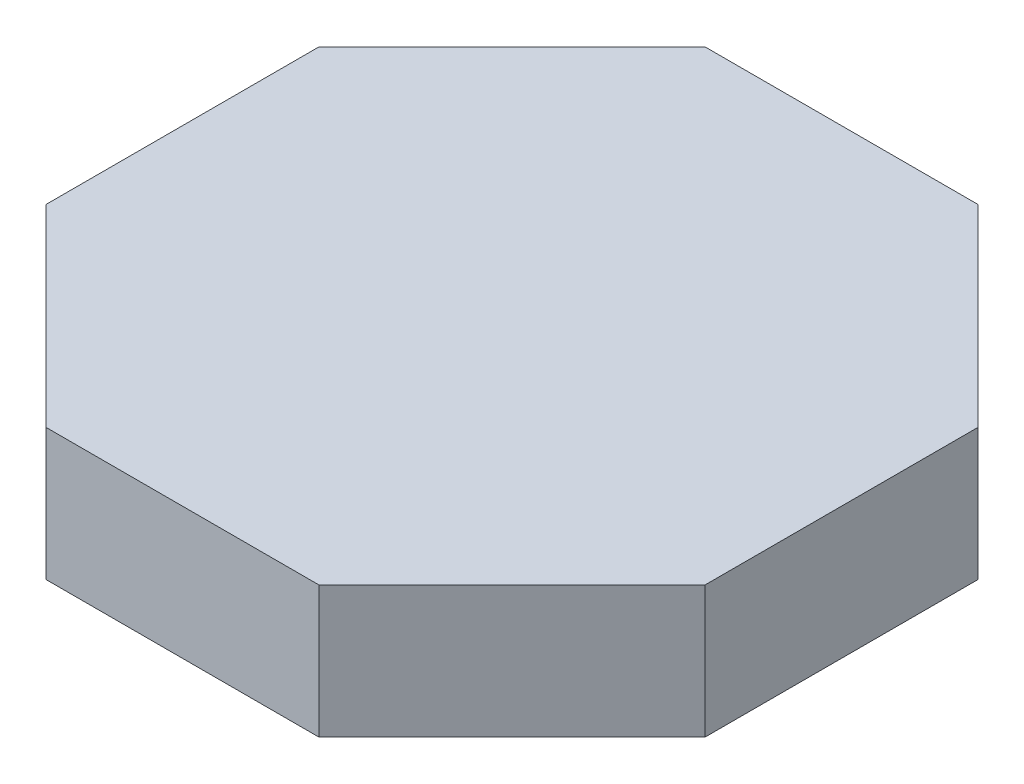
ISO-10303-21;
HEADER;
FILE_DESCRIPTION(('STEP AP214'),'2;1');
FILE_NAME('part.step','',(''),(''),'','','');
FILE_SCHEMA(('AUTOMOTIVE_DESIGN { 1 0 10303 214 1 1 1 1 }'));
ENDSEC;
DATA;
#1=APPLICATION_CONTEXT('core data for automotive mechanical design processes');
#2=APPLICATION_PROTOCOL_DEFINITION('international standard','automotive_design',2000,#1);
#3=PRODUCT_CONTEXT('',#1,'mechanical');
#4=PRODUCT('Part','Part','',(#3));
#5=PRODUCT_RELATED_PRODUCT_CATEGORY('part','',(#4));
#6=PRODUCT_DEFINITION_FORMATION('','',#4);
#7=PRODUCT_DEFINITION_CONTEXT('part definition',#1,'design');
#8=PRODUCT_DEFINITION('design','',#6,#7);
#9=PRODUCT_DEFINITION_SHAPE('','',#8);
#10=(LENGTH_UNIT() NAMED_UNIT(*) SI_UNIT(.MILLI.,.METRE.));
#11=(NAMED_UNIT(*) PLANE_ANGLE_UNIT() SI_UNIT($,.RADIAN.));
#12=(NAMED_UNIT(*) SI_UNIT($,.STERADIAN.) SOLID_ANGLE_UNIT());
#13=UNCERTAINTY_MEASURE_WITH_UNIT(LENGTH_MEASURE(1.E-05),#10,'distance_accuracy_value','');
#14=(GEOMETRIC_REPRESENTATION_CONTEXT(3) GLOBAL_UNCERTAINTY_ASSIGNED_CONTEXT((#13)) GLOBAL_UNIT_ASSIGNED_CONTEXT((#10,
#11,#12)) REPRESENTATION_CONTEXT('',''));
#15=CARTESIAN_POINT('',(0.,0.,0.));
#16=DIRECTION('',(0.,0.,1.));
#17=DIRECTION('',(1.,0.,0.));
#18=AXIS2_PLACEMENT_3D('',#15,#16,#17);
#19=CARTESIAN_POINT('',(10.3553390593274,10.,-25.));
#20=DIRECTION('',(0.,0.,1.));
#21=DIRECTION('',(1.,0.,0.));
#22=AXIS2_PLACEMENT_3D('',#19,#20,#21);
#23=PLANE('',#22);
#24=DIRECTION('',(-1.,0.,0.));
#25=VECTOR('',#24,1.);
#26=CARTESIAN_POINT('',(10.3553390593274,0.,-25.));
#27=LINE('',#26,#25);
#28=CARTESIAN_POINT('',(10.3553390593274,0.,-25.));
#29=VERTEX_POINT('',#28);
#30=CARTESIAN_POINT('',(-10.3553390593274,0.,-25.));
#31=VERTEX_POINT('',#30);
#32=EDGE_CURVE('E145',#29,#31,#27,.T.);
#33=ORIENTED_EDGE('',*,*,#32,.T.);
#34=DIRECTION('',(0.,-1.,0.));
#35=VECTOR('',#34,1.);
#36=CARTESIAN_POINT('',(-10.3553390593274,10.,-25.));
#37=LINE('',#36,#35);
#38=CARTESIAN_POINT('',(-10.3553390593274,10.,-25.));
#39=VERTEX_POINT('',#38);
#40=EDGE_CURVE('E12',#39,#31,#37,.T.);
#41=ORIENTED_EDGE('',*,*,#40,.F.);
#42=DIRECTION('',(-1.,0.,0.));
#43=VECTOR('',#42,1.);
#44=CARTESIAN_POINT('',(10.3553390593274,10.,-25.));
#45=LINE('',#44,#43);
#46=CARTESIAN_POINT('',(10.3553390593274,10.,-25.));
#47=VERTEX_POINT('',#46);
#48=EDGE_CURVE('E159',#47,#39,#45,.T.);
#49=ORIENTED_EDGE('',*,*,#48,.F.);
#50=DIRECTION('',(0.,-1.,0.));
#51=VECTOR('',#50,1.);
#52=CARTESIAN_POINT('',(10.3553390593274,10.,-25.));
#53=LINE('',#52,#51);
#54=EDGE_CURVE('E141',#47,#29,#53,.T.);
#55=ORIENTED_EDGE('',*,*,#54,.T.);
#56=EDGE_LOOP('',(#33,#41,#49,#55));
#57=FACE_BOUND('',#56,.T.);
#58=ADVANCED_FACE('F49',(#57),#23,.F.);
#59=CARTESIAN_POINT('',(-10.3553390593274,10.,-25.));
#60=DIRECTION('',(0.707106781186548,0.,0.707106781186547));
#61=DIRECTION('',(0.707106781186547,0.,-0.707106781186548));
#62=AXIS2_PLACEMENT_3D('',#59,#60,#61);
#63=PLANE('',#62);
#64=DIRECTION('',(-0.707106781186547,0.,0.707106781186548));
#65=VECTOR('',#64,1.);
#66=CARTESIAN_POINT('',(-10.3553390593274,0.,-25.));
#67=LINE('',#66,#65);
#68=CARTESIAN_POINT('',(-25.,0.,-10.3553390593274));
#69=VERTEX_POINT('',#68);
#70=EDGE_CURVE('E148',#31,#69,#67,.T.);
#71=ORIENTED_EDGE('',*,*,#70,.T.);
#72=DIRECTION('',(0.,-1.,0.));
#73=VECTOR('',#72,1.);
#74=CARTESIAN_POINT('',(-25.,10.,-10.3553390593274));
#75=LINE('',#74,#73);
#76=CARTESIAN_POINT('',(-25.,10.,-10.3553390593274));
#77=VERTEX_POINT('',#76);
#78=EDGE_CURVE('E57',#77,#69,#75,.T.);
#79=ORIENTED_EDGE('',*,*,#78,.F.);
#80=DIRECTION('',(-0.707106781186547,0.,0.707106781186548));
#81=VECTOR('',#80,1.);
#82=CARTESIAN_POINT('',(-10.3553390593274,10.,-25.));
#83=LINE('',#82,#81);
#84=EDGE_CURVE('E108',#39,#77,#83,.T.);
#85=ORIENTED_EDGE('',*,*,#84,.F.);
#86=ORIENTED_EDGE('',*,*,#40,.T.);
#87=EDGE_LOOP('',(#71,#79,#85,#86));
#88=FACE_BOUND('',#87,.T.);
#89=ADVANCED_FACE('F194',(#88),#63,.F.);
#90=CARTESIAN_POINT('',(-25.,10.,-10.3553390593274));
#91=DIRECTION('',(1.,0.,0.));
#92=DIRECTION('',(0.,0.,-1.));
#93=AXIS2_PLACEMENT_3D('',#90,#91,#92);
#94=PLANE('',#93);
#95=DIRECTION('',(0.,0.,1.));
#96=VECTOR('',#95,1.);
#97=CARTESIAN_POINT('',(-25.,0.,-10.3553390593274));
#98=LINE('',#97,#96);
#99=CARTESIAN_POINT('',(-25.,0.,10.3553390593274));
#100=VERTEX_POINT('',#99);
#101=EDGE_CURVE('E150',#69,#100,#98,.T.);
#102=ORIENTED_EDGE('',*,*,#101,.T.);
#103=DIRECTION('',(0.,-1.,0.));
#104=VECTOR('',#103,1.);
#105=CARTESIAN_POINT('',(-25.,10.,10.3553390593274));
#106=LINE('',#105,#104);
#107=CARTESIAN_POINT('',(-25.,10.,10.3553390593274));
#108=VERTEX_POINT('',#107);
#109=EDGE_CURVE('E166',#108,#100,#106,.T.);
#110=ORIENTED_EDGE('',*,*,#109,.F.);
#111=DIRECTION('',(0.,0.,1.));
#112=VECTOR('',#111,1.);
#113=CARTESIAN_POINT('',(-25.,10.,-10.3553390593274));
#114=LINE('',#113,#112);
#115=EDGE_CURVE('E174',#77,#108,#114,.T.);
#116=ORIENTED_EDGE('',*,*,#115,.F.);
#117=ORIENTED_EDGE('',*,*,#78,.T.);
#118=EDGE_LOOP('',(#102,#110,#116,#117));
#119=FACE_BOUND('',#118,.T.);
#120=ADVANCED_FACE('F172',(#119),#94,.F.);
#121=CARTESIAN_POINT('',(-25.,10.,10.3553390593274));
#122=DIRECTION('',(0.707106781186547,0.,-0.707106781186548));
#123=DIRECTION('',(-0.707106781186548,0.,-0.707106781186547));
#124=AXIS2_PLACEMENT_3D('',#121,#122,#123);
#125=PLANE('',#124);
#126=DIRECTION('',(0.707106781186548,0.,0.707106781186547));
#127=VECTOR('',#126,1.);
#128=CARTESIAN_POINT('',(-25.,0.,10.3553390593274));
#129=LINE('',#128,#127);
#130=CARTESIAN_POINT('',(-10.3553390593274,0.,25.));
#131=VERTEX_POINT('',#130);
#132=EDGE_CURVE('E152',#100,#131,#129,.T.);
#133=ORIENTED_EDGE('',*,*,#132,.T.);
#134=DIRECTION('',(0.,-1.,0.));
#135=VECTOR('',#134,1.);
#136=CARTESIAN_POINT('',(-10.3553390593274,10.,25.));
#137=LINE('',#136,#135);
#138=CARTESIAN_POINT('',(-10.3553390593274,10.,25.));
#139=VERTEX_POINT('',#138);
#140=EDGE_CURVE('E163',#139,#131,#137,.T.);
#141=ORIENTED_EDGE('',*,*,#140,.F.);
#142=DIRECTION('',(0.707106781186548,0.,0.707106781186547));
#143=VECTOR('',#142,1.);
#144=CARTESIAN_POINT('',(-25.,10.,10.3553390593274));
#145=LINE('',#144,#143);
#146=EDGE_CURVE('E186',#108,#139,#145,.T.);
#147=ORIENTED_EDGE('',*,*,#146,.F.);
#148=ORIENTED_EDGE('',*,*,#109,.T.);
#149=EDGE_LOOP('',(#133,#141,#147,#148));
#150=FACE_BOUND('',#149,.T.);
#151=ADVANCED_FACE('F182',(#150),#125,.F.);
#152=CARTESIAN_POINT('',(-10.3553390593274,10.,25.));
#153=DIRECTION('',(0.,0.,-1.));
#154=DIRECTION('',(-1.,0.,0.));
#155=AXIS2_PLACEMENT_3D('',#152,#153,#154);
#156=PLANE('',#155);
#157=DIRECTION('',(1.,0.,0.));
#158=VECTOR('',#157,1.);
#159=CARTESIAN_POINT('',(-10.3553390593274,0.,25.));
#160=LINE('',#159,#158);
#161=CARTESIAN_POINT('',(10.3553390593274,0.,25.));
#162=VERTEX_POINT('',#161);
#163=EDGE_CURVE('E154',#131,#162,#160,.T.);
#164=ORIENTED_EDGE('',*,*,#163,.T.);
#165=DIRECTION('',(0.,-1.,0.));
#166=VECTOR('',#165,1.);
#167=CARTESIAN_POINT('',(10.3553390593274,10.,25.));
#168=LINE('',#167,#166);
#169=CARTESIAN_POINT('',(10.3553390593274,10.,25.));
#170=VERTEX_POINT('',#169);
#171=EDGE_CURVE('E136',#170,#162,#168,.T.);
#172=ORIENTED_EDGE('',*,*,#171,.F.);
#173=DIRECTION('',(1.,0.,0.));
#174=VECTOR('',#173,1.);
#175=CARTESIAN_POINT('',(-10.3553390593274,10.,25.));
#176=LINE('',#175,#174);
#177=EDGE_CURVE('E127',#139,#170,#176,.T.);
#178=ORIENTED_EDGE('',*,*,#177,.F.);
#179=ORIENTED_EDGE('',*,*,#140,.T.);
#180=EDGE_LOOP('',(#164,#172,#178,#179));
#181=FACE_BOUND('',#180,.T.);
#182=ADVANCED_FACE('F185',(#181),#156,.F.);
#183=CARTESIAN_POINT('',(10.3553390593274,10.,25.));
#184=DIRECTION('',(-0.707106781186548,0.,-0.707106781186547));
#185=DIRECTION('',(-0.707106781186547,0.,0.707106781186548));
#186=AXIS2_PLACEMENT_3D('',#183,#184,#185);
#187=PLANE('',#186);
#188=DIRECTION('',(0.707106781186547,0.,-0.707106781186548));
#189=VECTOR('',#188,1.);
#190=CARTESIAN_POINT('',(10.3553390593274,0.,25.));
#191=LINE('',#190,#189);
#192=CARTESIAN_POINT('',(25.,0.,10.3553390593274));
#193=VERTEX_POINT('',#192);
#194=EDGE_CURVE('E135',#162,#193,#191,.T.);
#195=ORIENTED_EDGE('',*,*,#194,.T.);
#196=DIRECTION('',(0.,-1.,0.));
#197=VECTOR('',#196,1.);
#198=CARTESIAN_POINT('',(25.,10.,10.3553390593274));
#199=LINE('',#198,#197);
#200=CARTESIAN_POINT('',(25.,10.,10.3553390593274));
#201=VERTEX_POINT('',#200);
#202=EDGE_CURVE('E132',#201,#193,#199,.T.);
#203=ORIENTED_EDGE('',*,*,#202,.F.);
#204=DIRECTION('',(0.707106781186547,0.,-0.707106781186548));
#205=VECTOR('',#204,1.);
#206=CARTESIAN_POINT('',(10.3553390593274,10.,25.));
#207=LINE('',#206,#205);
#208=EDGE_CURVE('E121',#170,#201,#207,.T.);
#209=ORIENTED_EDGE('',*,*,#208,.F.);
#210=ORIENTED_EDGE('',*,*,#171,.T.);
#211=EDGE_LOOP('',(#195,#203,#209,#210));
#212=FACE_BOUND('',#211,.T.);
#213=ADVANCED_FACE('F133',(#212),#187,.F.);
#214=CARTESIAN_POINT('',(25.,10.,10.3553390593274));
#215=DIRECTION('',(-1.,0.,0.));
#216=DIRECTION('',(0.,0.,1.));
#217=AXIS2_PLACEMENT_3D('',#214,#215,#216);
#218=PLANE('',#217);
#219=DIRECTION('',(0.,0.,-1.));
#220=VECTOR('',#219,1.);
#221=CARTESIAN_POINT('',(25.,0.,10.3553390593274));
#222=LINE('',#221,#220);
#223=CARTESIAN_POINT('',(25.,0.,-10.3553390593274));
#224=VERTEX_POINT('',#223);
#225=EDGE_CURVE('E94',#193,#224,#222,.T.);
#226=ORIENTED_EDGE('',*,*,#225,.T.);
#227=DIRECTION('',(0.,-1.,0.));
#228=VECTOR('',#227,1.);
#229=CARTESIAN_POINT('',(25.,10.,-10.3553390593274));
#230=LINE('',#229,#228);
#231=CARTESIAN_POINT('',(25.,10.,-10.3553390593274));
#232=VERTEX_POINT('',#231);
#233=EDGE_CURVE('E137',#232,#224,#230,.T.);
#234=ORIENTED_EDGE('',*,*,#233,.F.);
#235=DIRECTION('',(0.,0.,-1.));
#236=VECTOR('',#235,1.);
#237=CARTESIAN_POINT('',(25.,10.,10.3553390593274));
#238=LINE('',#237,#236);
#239=EDGE_CURVE('E125',#201,#232,#238,.T.);
#240=ORIENTED_EDGE('',*,*,#239,.F.);
#241=ORIENTED_EDGE('',*,*,#202,.T.);
#242=EDGE_LOOP('',(#226,#234,#240,#241));
#243=FACE_BOUND('',#242,.T.);
#244=ADVANCED_FACE('F139',(#243),#218,.F.);
#245=CARTESIAN_POINT('',(25.,10.,-10.3553390593274));
#246=DIRECTION('',(-0.707106781186547,0.,0.707106781186548));
#247=DIRECTION('',(0.707106781186548,0.,0.707106781186547));
#248=AXIS2_PLACEMENT_3D('',#245,#246,#247);
#249=PLANE('',#248);
#250=DIRECTION('',(-0.707106781186548,0.,-0.707106781186547));
#251=VECTOR('',#250,1.);
#252=CARTESIAN_POINT('',(25.,0.,-10.3553390593274));
#253=LINE('',#252,#251);
#254=EDGE_CURVE('E100',#224,#29,#253,.T.);
#255=ORIENTED_EDGE('',*,*,#254,.T.);
#256=ORIENTED_EDGE('',*,*,#54,.F.);
#257=DIRECTION('',(-0.707106781186548,0.,-0.707106781186547));
#258=VECTOR('',#257,1.);
#259=CARTESIAN_POINT('',(25.,10.,-10.3553390593274));
#260=LINE('',#259,#258);
#261=EDGE_CURVE('E65',#232,#47,#260,.T.);
#262=ORIENTED_EDGE('',*,*,#261,.F.);
#263=ORIENTED_EDGE('',*,*,#233,.T.);
#264=EDGE_LOOP('',(#255,#256,#262,#263));
#265=FACE_BOUND('',#264,.T.);
#266=ADVANCED_FACE('F210',(#265),#249,.F.);
#267=CARTESIAN_POINT('',(0.,10.,0.));
#268=DIRECTION('',(0.,1.,0.));
#269=DIRECTION('',(0.,0.,1.));
#270=AXIS2_PLACEMENT_3D('',#267,#268,#269);
#271=PLANE('',#270);
#272=ORIENTED_EDGE('',*,*,#48,.T.);
#273=ORIENTED_EDGE('',*,*,#84,.T.);
#274=ORIENTED_EDGE('',*,*,#115,.T.);
#275=ORIENTED_EDGE('',*,*,#146,.T.);
#276=ORIENTED_EDGE('',*,*,#177,.T.);
#277=ORIENTED_EDGE('',*,*,#208,.T.);
#278=ORIENTED_EDGE('',*,*,#239,.T.);
#279=ORIENTED_EDGE('',*,*,#261,.T.);
#280=EDGE_LOOP('',(#272,#273,#274,#275,#276,#277,#278,#279));
#281=FACE_BOUND('',#280,.T.);
#282=ADVANCED_FACE('F123',(#281),#271,.T.);
#283=CARTESIAN_POINT('',(0.,0.,0.));
#284=DIRECTION('',(0.,1.,0.));
#285=DIRECTION('',(0.,0.,1.));
#286=AXIS2_PLACEMENT_3D('',#283,#284,#285);
#287=PLANE('',#286);
#288=ORIENTED_EDGE('',*,*,#32,.F.);
#289=ORIENTED_EDGE('',*,*,#254,.F.);
#290=ORIENTED_EDGE('',*,*,#225,.F.);
#291=ORIENTED_EDGE('',*,*,#194,.F.);
#292=ORIENTED_EDGE('',*,*,#163,.F.);
#293=ORIENTED_EDGE('',*,*,#132,.F.);
#294=ORIENTED_EDGE('',*,*,#101,.F.);
#295=ORIENTED_EDGE('',*,*,#70,.F.);
#296=EDGE_LOOP('',(#288,#289,#290,#291,#292,#293,#294,#295));
#297=FACE_BOUND('',#296,.T.);
#298=ADVANCED_FACE('F178',(#297),#287,.F.);
#299=CLOSED_SHELL('',(#58,#89,#120,#151,#182,#213,#244,#266,#282,#298));
#300=MANIFOLD_SOLID_BREP('B2',#299);
#301=CARTESIAN_POINT('',(10.3553390593274,10.,-25.));
#302=DIRECTION('',(0.,0.,1.));
#303=DIRECTION('',(1.,0.,0.));
#304=AXIS2_PLACEMENT_3D('',#301,#302,#303);
#305=PLANE('',#304);
#306=DIRECTION('',(-1.,0.,0.));
#307=VECTOR('',#306,1.);
#308=CARTESIAN_POINT('',(10.3553390593274,0.,-25.));
#309=LINE('',#308,#307);
#310=CARTESIAN_POINT('',(10.3553390593274,0.,-25.));
#311=VERTEX_POINT('',#310);
#312=CARTESIAN_POINT('',(-10.3553390593274,0.,-25.));
#313=VERTEX_POINT('',#312);
#314=EDGE_CURVE('E373',#311,#313,#309,.T.);
#315=ORIENTED_EDGE('',*,*,#314,.T.);
#316=DIRECTION('',(0.,-1.,0.));
#317=VECTOR('',#316,1.);
#318=CARTESIAN_POINT('',(-10.3553390593274,10.,-25.));
#319=LINE('',#318,#317);
#320=CARTESIAN_POINT('',(-10.3553390593274,10.,-25.));
#321=VERTEX_POINT('',#320);
#322=EDGE_CURVE('E47',#321,#313,#319,.T.);
#323=ORIENTED_EDGE('',*,*,#322,.F.);
#324=DIRECTION('',(-1.,0.,0.));
#325=VECTOR('',#324,1.);
#326=CARTESIAN_POINT('',(10.3553390593274,10.,-25.));
#327=LINE('',#326,#325);
#328=CARTESIAN_POINT('',(10.3553390593274,10.,-25.));
#329=VERTEX_POINT('',#328);
#330=EDGE_CURVE('E387',#329,#321,#327,.T.);
#331=ORIENTED_EDGE('',*,*,#330,.F.);
#332=DIRECTION('',(0.,-1.,0.));
#333=VECTOR('',#332,1.);
#334=CARTESIAN_POINT('',(10.3553390593274,10.,-25.));
#335=LINE('',#334,#333);
#336=EDGE_CURVE('E369',#329,#311,#335,.T.);
#337=ORIENTED_EDGE('',*,*,#336,.T.);
#338=EDGE_LOOP('',(#315,#323,#331,#337));
#339=FACE_BOUND('',#338,.T.);
#340=ADVANCED_FACE('F277',(#339),#305,.F.);
#341=CARTESIAN_POINT('',(-10.3553390593274,10.,-25.));
#342=DIRECTION('',(0.707106781186548,0.,0.707106781186547));
#343=DIRECTION('',(0.707106781186547,0.,-0.707106781186548));
#344=AXIS2_PLACEMENT_3D('',#341,#342,#343);
#345=PLANE('',#344);
#346=DIRECTION('',(-0.707106781186547,0.,0.707106781186548));
#347=VECTOR('',#346,1.);
#348=CARTESIAN_POINT('',(-10.3553390593274,0.,-25.));
#349=LINE('',#348,#347);
#350=CARTESIAN_POINT('',(-25.,0.,-10.3553390593274));
#351=VERTEX_POINT('',#350);
#352=EDGE_CURVE('E376',#313,#351,#349,.T.);
#353=ORIENTED_EDGE('',*,*,#352,.T.);
#354=DIRECTION('',(0.,-1.,0.));
#355=VECTOR('',#354,1.);
#356=CARTESIAN_POINT('',(-25.,10.,-10.3553390593274));
#357=LINE('',#356,#355);
#358=CARTESIAN_POINT('',(-25.,10.,-10.3553390593274));
#359=VERTEX_POINT('',#358);
#360=EDGE_CURVE('E285',#359,#351,#357,.T.);
#361=ORIENTED_EDGE('',*,*,#360,.F.);
#362=DIRECTION('',(-0.707106781186547,0.,0.707106781186548));
#363=VECTOR('',#362,1.);
#364=CARTESIAN_POINT('',(-10.3553390593274,10.,-25.));
#365=LINE('',#364,#363);
#366=EDGE_CURVE('E336',#321,#359,#365,.T.);
#367=ORIENTED_EDGE('',*,*,#366,.F.);
#368=ORIENTED_EDGE('',*,*,#322,.T.);
#369=EDGE_LOOP('',(#353,#361,#367,#368));
#370=FACE_BOUND('',#369,.T.);
#371=ADVANCED_FACE('F422',(#370),#345,.F.);
#372=CARTESIAN_POINT('',(-25.,10.,-10.3553390593274));
#373=DIRECTION('',(1.,0.,0.));
#374=DIRECTION('',(0.,0.,-1.));
#375=AXIS2_PLACEMENT_3D('',#372,#373,#374);
#376=PLANE('',#375);
#377=DIRECTION('',(0.,0.,1.));
#378=VECTOR('',#377,1.);
#379=CARTESIAN_POINT('',(-25.,0.,-10.3553390593274));
#380=LINE('',#379,#378);
#381=CARTESIAN_POINT('',(-25.,0.,10.3553390593274));
#382=VERTEX_POINT('',#381);
#383=EDGE_CURVE('E378',#351,#382,#380,.T.);
#384=ORIENTED_EDGE('',*,*,#383,.T.);
#385=DIRECTION('',(0.,-1.,0.));
#386=VECTOR('',#385,1.);
#387=CARTESIAN_POINT('',(-25.,10.,10.3553390593274));
#388=LINE('',#387,#386);
#389=CARTESIAN_POINT('',(-25.,10.,10.3553390593274));
#390=VERTEX_POINT('',#389);
#391=EDGE_CURVE('E394',#390,#382,#388,.T.);
#392=ORIENTED_EDGE('',*,*,#391,.F.);
#393=DIRECTION('',(0.,0.,1.));
#394=VECTOR('',#393,1.);
#395=CARTESIAN_POINT('',(-25.,10.,-10.3553390593274));
#396=LINE('',#395,#394);
#397=EDGE_CURVE('E402',#359,#390,#396,.T.);
#398=ORIENTED_EDGE('',*,*,#397,.F.);
#399=ORIENTED_EDGE('',*,*,#360,.T.);
#400=EDGE_LOOP('',(#384,#392,#398,#399));
#401=FACE_BOUND('',#400,.T.);
#402=ADVANCED_FACE('F400',(#401),#376,.F.);
#403=CARTESIAN_POINT('',(-25.,10.,10.3553390593274));
#404=DIRECTION('',(0.707106781186547,0.,-0.707106781186548));
#405=DIRECTION('',(-0.707106781186548,0.,-0.707106781186547));
#406=AXIS2_PLACEMENT_3D('',#403,#404,#405);
#407=PLANE('',#406);
#408=DIRECTION('',(0.707106781186548,0.,0.707106781186547));
#409=VECTOR('',#408,1.);
#410=CARTESIAN_POINT('',(-25.,0.,10.3553390593274));
#411=LINE('',#410,#409);
#412=CARTESIAN_POINT('',(-10.3553390593274,0.,25.));
#413=VERTEX_POINT('',#412);
#414=EDGE_CURVE('E380',#382,#413,#411,.T.);
#415=ORIENTED_EDGE('',*,*,#414,.T.);
#416=DIRECTION('',(0.,-1.,0.));
#417=VECTOR('',#416,1.);
#418=CARTESIAN_POINT('',(-10.3553390593274,10.,25.));
#419=LINE('',#418,#417);
#420=CARTESIAN_POINT('',(-10.3553390593274,10.,25.));
#421=VERTEX_POINT('',#420);
#422=EDGE_CURVE('E391',#421,#413,#419,.T.);
#423=ORIENTED_EDGE('',*,*,#422,.F.);
#424=DIRECTION('',(0.707106781186548,0.,0.707106781186547));
#425=VECTOR('',#424,1.);
#426=CARTESIAN_POINT('',(-25.,10.,10.3553390593274));
#427=LINE('',#426,#425);
#428=EDGE_CURVE('E414',#390,#421,#427,.T.);
#429=ORIENTED_EDGE('',*,*,#428,.F.);
#430=ORIENTED_EDGE('',*,*,#391,.T.);
#431=EDGE_LOOP('',(#415,#423,#429,#430));
#432=FACE_BOUND('',#431,.T.);
#433=ADVANCED_FACE('F410',(#432),#407,.F.);
#434=CARTESIAN_POINT('',(-10.3553390593274,10.,25.));
#435=DIRECTION('',(0.,0.,-1.));
#436=DIRECTION('',(-1.,0.,0.));
#437=AXIS2_PLACEMENT_3D('',#434,#435,#436);
#438=PLANE('',#437);
#439=DIRECTION('',(1.,0.,0.));
#440=VECTOR('',#439,1.);
#441=CARTESIAN_POINT('',(-10.3553390593274,0.,25.));
#442=LINE('',#441,#440);
#443=CARTESIAN_POINT('',(10.3553390593274,0.,25.));
#444=VERTEX_POINT('',#443);
#445=EDGE_CURVE('E382',#413,#444,#442,.T.);
#446=ORIENTED_EDGE('',*,*,#445,.T.);
#447=DIRECTION('',(0.,-1.,0.));
#448=VECTOR('',#447,1.);
#449=CARTESIAN_POINT('',(10.3553390593274,10.,25.));
#450=LINE('',#449,#448);
#451=CARTESIAN_POINT('',(10.3553390593274,10.,25.));
#452=VERTEX_POINT('',#451);
#453=EDGE_CURVE('E364',#452,#444,#450,.T.);
#454=ORIENTED_EDGE('',*,*,#453,.F.);
#455=DIRECTION('',(1.,0.,0.));
#456=VECTOR('',#455,1.);
#457=CARTESIAN_POINT('',(-10.3553390593274,10.,25.));
#458=LINE('',#457,#456);
#459=EDGE_CURVE('E355',#421,#452,#458,.T.);
#460=ORIENTED_EDGE('',*,*,#459,.F.);
#461=ORIENTED_EDGE('',*,*,#422,.T.);
#462=EDGE_LOOP('',(#446,#454,#460,#461));
#463=FACE_BOUND('',#462,.T.);
#464=ADVANCED_FACE('F413',(#463),#438,.F.);
#465=CARTESIAN_POINT('',(10.3553390593274,10.,25.));
#466=DIRECTION('',(-0.707106781186548,0.,-0.707106781186547));
#467=DIRECTION('',(-0.707106781186547,0.,0.707106781186548));
#468=AXIS2_PLACEMENT_3D('',#465,#466,#467);
#469=PLANE('',#468);
#470=DIRECTION('',(0.707106781186547,0.,-0.707106781186548));
#471=VECTOR('',#470,1.);
#472=CARTESIAN_POINT('',(10.3553390593274,0.,25.));
#473=LINE('',#472,#471);
#474=CARTESIAN_POINT('',(25.,0.,10.3553390593274));
#475=VERTEX_POINT('',#474);
#476=EDGE_CURVE('E363',#444,#475,#473,.T.);
#477=ORIENTED_EDGE('',*,*,#476,.T.);
#478=DIRECTION('',(0.,-1.,0.));
#479=VECTOR('',#478,1.);
#480=CARTESIAN_POINT('',(25.,10.,10.3553390593274));
#481=LINE('',#480,#479);
#482=CARTESIAN_POINT('',(25.,10.,10.3553390593274));
#483=VERTEX_POINT('',#482);
#484=EDGE_CURVE('E360',#483,#475,#481,.T.);
#485=ORIENTED_EDGE('',*,*,#484,.F.);
#486=DIRECTION('',(0.707106781186547,0.,-0.707106781186548));
#487=VECTOR('',#486,1.);
#488=CARTESIAN_POINT('',(10.3553390593274,10.,25.));
#489=LINE('',#488,#487);
#490=EDGE_CURVE('E349',#452,#483,#489,.T.);
#491=ORIENTED_EDGE('',*,*,#490,.F.);
#492=ORIENTED_EDGE('',*,*,#453,.T.);
#493=EDGE_LOOP('',(#477,#485,#491,#492));
#494=FACE_BOUND('',#493,.T.);
#495=ADVANCED_FACE('F361',(#494),#469,.F.);
#496=CARTESIAN_POINT('',(25.,10.,10.3553390593274));
#497=DIRECTION('',(-1.,0.,0.));
#498=DIRECTION('',(0.,0.,1.));
#499=AXIS2_PLACEMENT_3D('',#496,#497,#498);
#500=PLANE('',#499);
#501=DIRECTION('',(0.,0.,-1.));
#502=VECTOR('',#501,1.);
#503=CARTESIAN_POINT('',(25.,0.,10.3553390593274));
#504=LINE('',#503,#502);
#505=CARTESIAN_POINT('',(25.,0.,-10.3553390593274));
#506=VERTEX_POINT('',#505);
#507=EDGE_CURVE('E322',#475,#506,#504,.T.);
#508=ORIENTED_EDGE('',*,*,#507,.T.);
#509=DIRECTION('',(0.,-1.,0.));
#510=VECTOR('',#509,1.);
#511=CARTESIAN_POINT('',(25.,10.,-10.3553390593274));
#512=LINE('',#511,#510);
#513=CARTESIAN_POINT('',(25.,10.,-10.3553390593274));
#514=VERTEX_POINT('',#513);
#515=EDGE_CURVE('E365',#514,#506,#512,.T.);
#516=ORIENTED_EDGE('',*,*,#515,.F.);
#517=DIRECTION('',(0.,0.,-1.));
#518=VECTOR('',#517,1.);
#519=CARTESIAN_POINT('',(25.,10.,10.3553390593274));
#520=LINE('',#519,#518);
#521=EDGE_CURVE('E353',#483,#514,#520,.T.);
#522=ORIENTED_EDGE('',*,*,#521,.F.);
#523=ORIENTED_EDGE('',*,*,#484,.T.);
#524=EDGE_LOOP('',(#508,#516,#522,#523));
#525=FACE_BOUND('',#524,.T.);
#526=ADVANCED_FACE('F367',(#525),#500,.F.);
#527=CARTESIAN_POINT('',(25.,10.,-10.3553390593274));
#528=DIRECTION('',(-0.707106781186547,0.,0.707106781186548));
#529=DIRECTION('',(0.707106781186548,0.,0.707106781186547));
#530=AXIS2_PLACEMENT_3D('',#527,#528,#529);
#531=PLANE('',#530);
#532=DIRECTION('',(-0.707106781186548,0.,-0.707106781186547));
#533=VECTOR('',#532,1.);
#534=CARTESIAN_POINT('',(25.,0.,-10.3553390593274));
#535=LINE('',#534,#533);
#536=EDGE_CURVE('E328',#506,#311,#535,.T.);
#537=ORIENTED_EDGE('',*,*,#536,.T.);
#538=ORIENTED_EDGE('',*,*,#336,.F.);
#539=DIRECTION('',(-0.707106781186548,0.,-0.707106781186547));
#540=VECTOR('',#539,1.);
#541=CARTESIAN_POINT('',(25.,10.,-10.3553390593274));
#542=LINE('',#541,#540);
#543=EDGE_CURVE('E293',#514,#329,#542,.T.);
#544=ORIENTED_EDGE('',*,*,#543,.F.);
#545=ORIENTED_EDGE('',*,*,#515,.T.);
#546=EDGE_LOOP('',(#537,#538,#544,#545));
#547=FACE_BOUND('',#546,.T.);
#548=ADVANCED_FACE('F438',(#547),#531,.F.);
#549=CARTESIAN_POINT('',(0.,10.,0.));
#550=DIRECTION('',(0.,1.,0.));
#551=DIRECTION('',(0.,0.,1.));
#552=AXIS2_PLACEMENT_3D('',#549,#550,#551);
#553=PLANE('',#552);
#554=ORIENTED_EDGE('',*,*,#330,.T.);
#555=ORIENTED_EDGE('',*,*,#366,.T.);
#556=ORIENTED_EDGE('',*,*,#397,.T.);
#557=ORIENTED_EDGE('',*,*,#428,.T.);
#558=ORIENTED_EDGE('',*,*,#459,.T.);
#559=ORIENTED_EDGE('',*,*,#490,.T.);
#560=ORIENTED_EDGE('',*,*,#521,.T.);
#561=ORIENTED_EDGE('',*,*,#543,.T.);
#562=EDGE_LOOP('',(#554,#555,#556,#557,#558,#559,#560,#561));
#563=FACE_BOUND('',#562,.T.);
#564=ADVANCED_FACE('F351',(#563),#553,.T.);
#565=CARTESIAN_POINT('',(0.,0.,0.));
#566=DIRECTION('',(0.,1.,0.));
#567=DIRECTION('',(0.,0.,1.));
#568=AXIS2_PLACEMENT_3D('',#565,#566,#567);
#569=PLANE('',#568);
#570=ORIENTED_EDGE('',*,*,#314,.F.);
#571=ORIENTED_EDGE('',*,*,#536,.F.);
#572=ORIENTED_EDGE('',*,*,#507,.F.);
#573=ORIENTED_EDGE('',*,*,#476,.F.);
#574=ORIENTED_EDGE('',*,*,#445,.F.);
#575=ORIENTED_EDGE('',*,*,#414,.F.);
#576=ORIENTED_EDGE('',*,*,#383,.F.);
#577=ORIENTED_EDGE('',*,*,#352,.F.);
#578=EDGE_LOOP('',(#570,#571,#572,#573,#574,#575,#576,#577));
#579=FACE_BOUND('',#578,.T.);
#580=ADVANCED_FACE('F406',(#579),#569,.F.);
#581=CLOSED_SHELL('',(#340,#371,#402,#433,#464,#495,#526,#548,#564,#580));
#582=MANIFOLD_SOLID_BREP('B6',#581);
#583=ADVANCED_BREP_SHAPE_REPRESENTATION('',(#18,#300,#582),#14);
#584=SHAPE_DEFINITION_REPRESENTATION(#9,#583);
ENDSEC;
END-ISO-10303-21;
